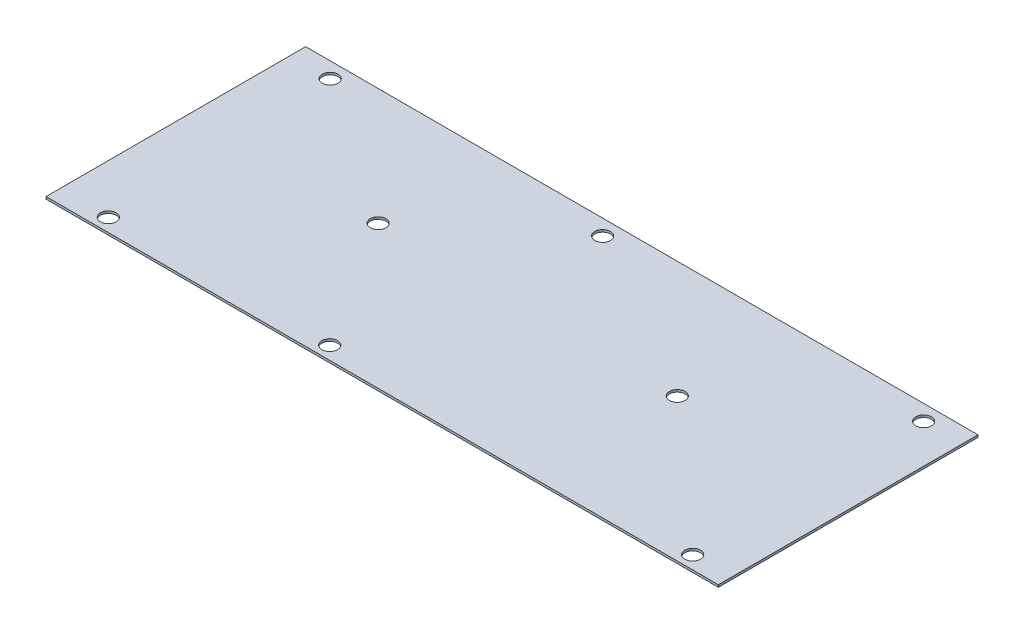
ISO-10303-21;
HEADER;
FILE_DESCRIPTION(('STEP AP214'),'2;1');
FILE_NAME('part.step','',(''),(''),'','','');
FILE_SCHEMA(('AUTOMOTIVE_DESIGN { 1 0 10303 214 1 1 1 1 }'));
ENDSEC;
DATA;
#1=APPLICATION_CONTEXT('core data for automotive mechanical design processes');
#2=APPLICATION_PROTOCOL_DEFINITION('international standard','automotive_design',2000,#1);
#3=PRODUCT_CONTEXT('',#1,'mechanical');
#4=PRODUCT('Part','Part','',(#3));
#5=PRODUCT_RELATED_PRODUCT_CATEGORY('part','',(#4));
#6=PRODUCT_DEFINITION_FORMATION('','',#4);
#7=PRODUCT_DEFINITION_CONTEXT('part definition',#1,'design');
#8=PRODUCT_DEFINITION('design','',#6,#7);
#9=PRODUCT_DEFINITION_SHAPE('','',#8);
#10=(LENGTH_UNIT() NAMED_UNIT(*) SI_UNIT(.MILLI.,.METRE.));
#11=(NAMED_UNIT(*) PLANE_ANGLE_UNIT() SI_UNIT($,.RADIAN.));
#12=(NAMED_UNIT(*) SI_UNIT($,.STERADIAN.) SOLID_ANGLE_UNIT());
#13=UNCERTAINTY_MEASURE_WITH_UNIT(LENGTH_MEASURE(1.E-05),#10,'distance_accuracy_value','');
#14=(GEOMETRIC_REPRESENTATION_CONTEXT(3) GLOBAL_UNCERTAINTY_ASSIGNED_CONTEXT((#13)) GLOBAL_UNIT_ASSIGNED_CONTEXT((#10,
#11,#12)) REPRESENTATION_CONTEXT('',''));
#15=CARTESIAN_POINT('',(0.,0.,0.));
#16=DIRECTION('',(0.,0.,1.));
#17=DIRECTION('',(1.,0.,0.));
#18=AXIS2_PLACEMENT_3D('',#15,#16,#17);
#19=CARTESIAN_POINT('',(0.,1.016,0.));
#20=DIRECTION('',(0.,-1.,0.));
#21=DIRECTION('',(0.,0.,-1.));
#22=AXIS2_PLACEMENT_3D('',#19,#20,#21);
#23=PLANE('',#22);
#24=DIRECTION('',(0.,0.,-1.));
#25=VECTOR('',#24,1.);
#26=CARTESIAN_POINT('',(150.0251,1.016,57.9374));
#27=LINE('',#26,#25);
#28=CARTESIAN_POINT('',(150.0251,1.016,57.9374));
#29=VERTEX_POINT('',#28);
#30=CARTESIAN_POINT('',(150.0251,1.016,-57.9374));
#31=VERTEX_POINT('',#30);
#32=EDGE_CURVE('E101',#29,#31,#27,.T.);
#33=ORIENTED_EDGE('',*,*,#32,.T.);
#34=DIRECTION('',(-1.,0.,0.));
#35=VECTOR('',#34,1.);
#36=CARTESIAN_POINT('',(-150.0251,1.016,-57.9374));
#37=LINE('',#36,#35);
#38=CARTESIAN_POINT('',(-150.0251,1.016,-57.9374));
#39=VERTEX_POINT('',#38);
#40=EDGE_CURVE('E96',#31,#39,#37,.T.);
#41=ORIENTED_EDGE('',*,*,#40,.T.);
#42=DIRECTION('',(0.,0.,1.));
#43=VECTOR('',#42,1.);
#44=CARTESIAN_POINT('',(-150.0251,1.016,57.9374));
#45=LINE('',#44,#43);
#46=CARTESIAN_POINT('',(-150.0251,1.016,57.9374));
#47=VERTEX_POINT('',#46);
#48=EDGE_CURVE('E99',#39,#47,#45,.T.);
#49=ORIENTED_EDGE('',*,*,#48,.T.);
#50=DIRECTION('',(1.,0.,0.));
#51=VECTOR('',#50,1.);
#52=CARTESIAN_POINT('',(-150.0251,1.016,57.9374));
#53=LINE('',#52,#51);
#54=EDGE_CURVE('E66',#47,#29,#53,.T.);
#55=ORIENTED_EDGE('',*,*,#54,.T.);
#56=EDGE_LOOP('',(#33,#41,#49,#55));
#57=FACE_BOUND('',#56,.T.);
#58=CARTESIAN_POINT('',(-128.1049,1.016,52.0446));
#59=DIRECTION('',(0.,1.,0.));
#60=DIRECTION('',(0.,0.,1.));
#61=AXIS2_PLACEMENT_3D('',#58,#59,#60);
#62=CIRCLE('',#61,3.50519999999998);
#63=CARTESIAN_POINT('',(-128.1049,1.016,55.5498));
#64=VERTEX_POINT('',#63);
#65=EDGE_CURVE('E129',#64,#64,#62,.T.);
#66=ORIENTED_EDGE('',*,*,#65,.F.);
#67=EDGE_LOOP('',(#66));
#68=FACE_BOUND('',#67,.T.);
#69=CARTESIAN_POINT('',(-132.1689,1.016,-51.0286));
#70=DIRECTION('',(0.,1.,0.));
#71=DIRECTION('',(0.,0.,1.));
#72=AXIS2_PLACEMENT_3D('',#69,#70,#71);
#73=CIRCLE('',#72,3.50520000000001);
#74=CARTESIAN_POINT('',(-132.1689,1.016,-47.5234));
#75=VERTEX_POINT('',#74);
#76=EDGE_CURVE('E140',#75,#75,#73,.T.);
#77=ORIENTED_EDGE('',*,*,#76,.F.);
#78=EDGE_LOOP('',(#77));
#79=FACE_BOUND('',#78,.T.);
#80=CARTESIAN_POINT('',(-10.5791,1.016,-51.0286));
#81=DIRECTION('',(0.,1.,0.));
#82=DIRECTION('',(0.,0.,1.));
#83=AXIS2_PLACEMENT_3D('',#80,#81,#82);
#84=CIRCLE('',#83,3.50519999999999);
#85=CARTESIAN_POINT('',(-10.5791,1.016,-47.5234));
#86=VERTEX_POINT('',#85);
#87=EDGE_CURVE('E166',#86,#86,#84,.T.);
#88=ORIENTED_EDGE('',*,*,#87,.F.);
#89=EDGE_LOOP('',(#88));
#90=FACE_BOUND('',#89,.T.);
#91=CARTESIAN_POINT('',(132.6769,1.016,-51.0286));
#92=DIRECTION('',(0.,1.,0.));
#93=DIRECTION('',(0.,0.,1.));
#94=AXIS2_PLACEMENT_3D('',#91,#92,#93);
#95=CIRCLE('',#94,3.50519999999998);
#96=CARTESIAN_POINT('',(132.6769,1.016,-47.5234));
#97=VERTEX_POINT('',#96);
#98=EDGE_CURVE('E173',#97,#97,#95,.T.);
#99=ORIENTED_EDGE('',*,*,#98,.F.);
#100=EDGE_LOOP('',(#99));
#101=FACE_BOUND('',#100,.T.);
#102=CARTESIAN_POINT('',(132.6769,1.016,52.0446));
#103=DIRECTION('',(0.,1.,0.));
#104=DIRECTION('',(0.,0.,1.));
#105=AXIS2_PLACEMENT_3D('',#102,#103,#104);
#106=CIRCLE('',#105,3.50519999999998);
#107=CARTESIAN_POINT('',(132.6769,1.016,55.5498));
#108=VERTEX_POINT('',#107);
#109=EDGE_CURVE('E181',#108,#108,#106,.T.);
#110=ORIENTED_EDGE('',*,*,#109,.F.);
#111=EDGE_LOOP('',(#110));
#112=FACE_BOUND('',#111,.T.);
#113=CARTESIAN_POINT('',(-29.2989,1.016,52.0446));
#114=DIRECTION('',(0.,1.,0.));
#115=DIRECTION('',(0.,0.,1.));
#116=AXIS2_PLACEMENT_3D('',#113,#114,#115);
#117=CIRCLE('',#116,3.5052);
#118=CARTESIAN_POINT('',(-29.2989,1.016,55.5498));
#119=VERTEX_POINT('',#118);
#120=EDGE_CURVE('E189',#119,#119,#117,.T.);
#121=ORIENTED_EDGE('',*,*,#120,.F.);
#122=EDGE_LOOP('',(#121));
#123=FACE_BOUND('',#122,.T.);
#124=CARTESIAN_POINT('',(67.9069,1.016,-5.86739999999999));
#125=DIRECTION('',(0.,1.,0.));
#126=DIRECTION('',(0.,0.,1.));
#127=AXIS2_PLACEMENT_3D('',#124,#125,#126);
#128=CIRCLE('',#127,3.50519999999999);
#129=CARTESIAN_POINT('',(67.9069,1.016,-2.3622));
#130=VERTEX_POINT('',#129);
#131=EDGE_CURVE('E197',#130,#130,#128,.T.);
#132=ORIENTED_EDGE('',*,*,#131,.F.);
#133=EDGE_LOOP('',(#132));
#134=FACE_BOUND('',#133,.T.);
#135=CARTESIAN_POINT('',(-65.6209,1.016,-5.8674));
#136=DIRECTION('',(0.,1.,0.));
#137=DIRECTION('',(0.,0.,1.));
#138=AXIS2_PLACEMENT_3D('',#135,#136,#137);
#139=CIRCLE('',#138,3.50519999999999);
#140=CARTESIAN_POINT('',(-65.6209,1.016,-2.36220000000001));
#141=VERTEX_POINT('',#140);
#142=EDGE_CURVE('E205',#141,#141,#139,.T.);
#143=ORIENTED_EDGE('',*,*,#142,.F.);
#144=EDGE_LOOP('',(#143));
#145=FACE_BOUND('',#144,.T.);
#146=ADVANCED_FACE('F48',(#57,#68,#79,#90,#101,#112,#123,#134,#145),#23,.F.);
#147=CARTESIAN_POINT('',(0.,0.,0.));
#148=DIRECTION('',(0.,-1.,0.));
#149=DIRECTION('',(0.,0.,-1.));
#150=AXIS2_PLACEMENT_3D('',#147,#148,#149);
#151=PLANE('',#150);
#152=CARTESIAN_POINT('',(67.9069,0.,-5.86739999999999));
#153=DIRECTION('',(0.,1.,0.));
#154=DIRECTION('',(0.,0.,1.));
#155=AXIS2_PLACEMENT_3D('',#152,#153,#154);
#156=CIRCLE('',#155,3.50519999999999);
#157=CARTESIAN_POINT('',(67.9069,0.,-2.3622));
#158=VERTEX_POINT('',#157);
#159=EDGE_CURVE('E201',#158,#158,#156,.T.);
#160=ORIENTED_EDGE('',*,*,#159,.T.);
#161=EDGE_LOOP('',(#160));
#162=FACE_BOUND('',#161,.T.);
#163=CARTESIAN_POINT('',(132.6769,0.,52.0446));
#164=DIRECTION('',(0.,1.,0.));
#165=DIRECTION('',(0.,0.,1.));
#166=AXIS2_PLACEMENT_3D('',#163,#164,#165);
#167=CIRCLE('',#166,3.50519999999998);
#168=CARTESIAN_POINT('',(132.6769,0.,55.5498));
#169=VERTEX_POINT('',#168);
#170=EDGE_CURVE('E185',#169,#169,#167,.T.);
#171=ORIENTED_EDGE('',*,*,#170,.T.);
#172=EDGE_LOOP('',(#171));
#173=FACE_BOUND('',#172,.T.);
#174=CARTESIAN_POINT('',(-10.5791,0.,-51.0286));
#175=DIRECTION('',(0.,1.,0.));
#176=DIRECTION('',(0.,0.,1.));
#177=AXIS2_PLACEMENT_3D('',#174,#175,#176);
#178=CIRCLE('',#177,3.50519999999999);
#179=CARTESIAN_POINT('',(-10.5791,0.,-47.5234));
#180=VERTEX_POINT('',#179);
#181=EDGE_CURVE('E169',#180,#180,#178,.T.);
#182=ORIENTED_EDGE('',*,*,#181,.T.);
#183=EDGE_LOOP('',(#182));
#184=FACE_BOUND('',#183,.T.);
#185=CARTESIAN_POINT('',(-128.1049,0.,52.0446));
#186=DIRECTION('',(0.,1.,0.));
#187=DIRECTION('',(0.,0.,1.));
#188=AXIS2_PLACEMENT_3D('',#185,#186,#187);
#189=CIRCLE('',#188,3.50519999999998);
#190=CARTESIAN_POINT('',(-128.1049,0.,55.5498));
#191=VERTEX_POINT('',#190);
#192=EDGE_CURVE('E136',#191,#191,#189,.T.);
#193=ORIENTED_EDGE('',*,*,#192,.T.);
#194=EDGE_LOOP('',(#193));
#195=FACE_BOUND('',#194,.T.);
#196=DIRECTION('',(0.,0.,-1.));
#197=VECTOR('',#196,1.);
#198=CARTESIAN_POINT('',(150.0251,0.,57.9374));
#199=LINE('',#198,#197);
#200=CARTESIAN_POINT('',(150.0251,0.,57.9374));
#201=VERTEX_POINT('',#200);
#202=CARTESIAN_POINT('',(150.0251,0.,-57.9374));
#203=VERTEX_POINT('',#202);
#204=EDGE_CURVE('E135',#201,#203,#199,.T.);
#205=ORIENTED_EDGE('',*,*,#204,.F.);
#206=DIRECTION('',(1.,0.,0.));
#207=VECTOR('',#206,1.);
#208=CARTESIAN_POINT('',(-150.0251,0.,57.9374));
#209=LINE('',#208,#207);
#210=CARTESIAN_POINT('',(-150.0251,0.,57.9374));
#211=VERTEX_POINT('',#210);
#212=EDGE_CURVE('E89',#211,#201,#209,.T.);
#213=ORIENTED_EDGE('',*,*,#212,.F.);
#214=DIRECTION('',(0.,0.,1.));
#215=VECTOR('',#214,1.);
#216=CARTESIAN_POINT('',(-150.0251,0.,57.9374));
#217=LINE('',#216,#215);
#218=CARTESIAN_POINT('',(-150.0251,0.,-57.9374));
#219=VERTEX_POINT('',#218);
#220=EDGE_CURVE('E83',#219,#211,#217,.T.);
#221=ORIENTED_EDGE('',*,*,#220,.F.);
#222=DIRECTION('',(-1.,0.,0.));
#223=VECTOR('',#222,1.);
#224=CARTESIAN_POINT('',(-150.0251,0.,-57.9374));
#225=LINE('',#224,#223);
#226=EDGE_CURVE('E106',#203,#219,#225,.T.);
#227=ORIENTED_EDGE('',*,*,#226,.F.);
#228=EDGE_LOOP('',(#205,#213,#221,#227));
#229=FACE_BOUND('',#228,.T.);
#230=CARTESIAN_POINT('',(-132.1689,0.,-51.0286));
#231=DIRECTION('',(0.,1.,0.));
#232=DIRECTION('',(0.,0.,1.));
#233=AXIS2_PLACEMENT_3D('',#230,#231,#232);
#234=CIRCLE('',#233,3.50520000000001);
#235=CARTESIAN_POINT('',(-132.1689,0.,-47.5234));
#236=VERTEX_POINT('',#235);
#237=EDGE_CURVE('E137',#236,#236,#234,.T.);
#238=ORIENTED_EDGE('',*,*,#237,.T.);
#239=EDGE_LOOP('',(#238));
#240=FACE_BOUND('',#239,.T.);
#241=CARTESIAN_POINT('',(132.6769,0.,-51.0286));
#242=DIRECTION('',(0.,1.,0.));
#243=DIRECTION('',(0.,0.,1.));
#244=AXIS2_PLACEMENT_3D('',#241,#242,#243);
#245=CIRCLE('',#244,3.50519999999998);
#246=CARTESIAN_POINT('',(132.6769,0.,-47.5234));
#247=VERTEX_POINT('',#246);
#248=EDGE_CURVE('E177',#247,#247,#245,.T.);
#249=ORIENTED_EDGE('',*,*,#248,.T.);
#250=EDGE_LOOP('',(#249));
#251=FACE_BOUND('',#250,.T.);
#252=CARTESIAN_POINT('',(-29.2989,0.,52.0446));
#253=DIRECTION('',(0.,1.,0.));
#254=DIRECTION('',(0.,0.,1.));
#255=AXIS2_PLACEMENT_3D('',#252,#253,#254);
#256=CIRCLE('',#255,3.5052);
#257=CARTESIAN_POINT('',(-29.2989,0.,55.5498));
#258=VERTEX_POINT('',#257);
#259=EDGE_CURVE('E193',#258,#258,#256,.T.);
#260=ORIENTED_EDGE('',*,*,#259,.T.);
#261=EDGE_LOOP('',(#260));
#262=FACE_BOUND('',#261,.T.);
#263=CARTESIAN_POINT('',(-65.6209,0.,-5.8674));
#264=DIRECTION('',(0.,1.,0.));
#265=DIRECTION('',(0.,0.,1.));
#266=AXIS2_PLACEMENT_3D('',#263,#264,#265);
#267=CIRCLE('',#266,3.50519999999999);
#268=CARTESIAN_POINT('',(-65.6209,0.,-2.36220000000001));
#269=VERTEX_POINT('',#268);
#270=EDGE_CURVE('E209',#269,#269,#267,.T.);
#271=ORIENTED_EDGE('',*,*,#270,.T.);
#272=EDGE_LOOP('',(#271));
#273=FACE_BOUND('',#272,.T.);
#274=ADVANCED_FACE('F155',(#162,#173,#184,#195,#229,#240,#251,#262,#273),#151,.T.);
#275=CARTESIAN_POINT('',(150.0251,1.016,57.9374));
#276=DIRECTION('',(-1.,0.,0.));
#277=DIRECTION('',(0.,0.,1.));
#278=AXIS2_PLACEMENT_3D('',#275,#276,#277);
#279=PLANE('',#278);
#280=ORIENTED_EDGE('',*,*,#204,.T.);
#281=DIRECTION('',(0.,-1.,0.));
#282=VECTOR('',#281,1.);
#283=CARTESIAN_POINT('',(150.0251,1.016,-57.9374));
#284=LINE('',#283,#282);
#285=EDGE_CURVE('E12',#31,#203,#284,.T.);
#286=ORIENTED_EDGE('',*,*,#285,.F.);
#287=ORIENTED_EDGE('',*,*,#32,.F.);
#288=DIRECTION('',(0.,-1.,0.));
#289=VECTOR('',#288,1.);
#290=CARTESIAN_POINT('',(150.0251,1.016,57.9374));
#291=LINE('',#290,#289);
#292=EDGE_CURVE('E113',#29,#201,#291,.T.);
#293=ORIENTED_EDGE('',*,*,#292,.T.);
#294=EDGE_LOOP('',(#280,#286,#287,#293));
#295=FACE_BOUND('',#294,.T.);
#296=ADVANCED_FACE('F50',(#295),#279,.F.);
#297=CARTESIAN_POINT('',(-150.0251,1.016,-57.9374));
#298=DIRECTION('',(0.,0.,1.));
#299=DIRECTION('',(1.,0.,0.));
#300=AXIS2_PLACEMENT_3D('',#297,#298,#299);
#301=PLANE('',#300);
#302=ORIENTED_EDGE('',*,*,#226,.T.);
#303=DIRECTION('',(0.,-1.,0.));
#304=VECTOR('',#303,1.);
#305=CARTESIAN_POINT('',(-150.0251,1.016,-57.9374));
#306=LINE('',#305,#304);
#307=EDGE_CURVE('E58',#39,#219,#306,.T.);
#308=ORIENTED_EDGE('',*,*,#307,.F.);
#309=ORIENTED_EDGE('',*,*,#40,.F.);
#310=ORIENTED_EDGE('',*,*,#285,.T.);
#311=EDGE_LOOP('',(#302,#308,#309,#310));
#312=FACE_BOUND('',#311,.T.);
#313=ADVANCED_FACE('F105',(#312),#301,.F.);
#314=CARTESIAN_POINT('',(-150.0251,1.016,57.9374));
#315=DIRECTION('',(1.,0.,0.));
#316=DIRECTION('',(0.,0.,-1.));
#317=AXIS2_PLACEMENT_3D('',#314,#315,#316);
#318=PLANE('',#317);
#319=ORIENTED_EDGE('',*,*,#220,.T.);
#320=DIRECTION('',(0.,-1.,0.));
#321=VECTOR('',#320,1.);
#322=CARTESIAN_POINT('',(-150.0251,1.016,57.9374));
#323=LINE('',#322,#321);
#324=EDGE_CURVE('E108',#47,#211,#323,.T.);
#325=ORIENTED_EDGE('',*,*,#324,.F.);
#326=ORIENTED_EDGE('',*,*,#48,.F.);
#327=ORIENTED_EDGE('',*,*,#307,.T.);
#328=EDGE_LOOP('',(#319,#325,#326,#327));
#329=FACE_BOUND('',#328,.T.);
#330=ADVANCED_FACE('F109',(#329),#318,.F.);
#331=CARTESIAN_POINT('',(-150.0251,1.016,57.9374));
#332=DIRECTION('',(0.,0.,-1.));
#333=DIRECTION('',(-1.,0.,0.));
#334=AXIS2_PLACEMENT_3D('',#331,#332,#333);
#335=PLANE('',#334);
#336=ORIENTED_EDGE('',*,*,#212,.T.);
#337=ORIENTED_EDGE('',*,*,#292,.F.);
#338=ORIENTED_EDGE('',*,*,#54,.F.);
#339=ORIENTED_EDGE('',*,*,#324,.T.);
#340=EDGE_LOOP('',(#336,#337,#338,#339));
#341=FACE_BOUND('',#340,.T.);
#342=ADVANCED_FACE('F152',(#341),#335,.F.);
#343=CARTESIAN_POINT('',(-128.1049,1.016,52.0446));
#344=DIRECTION('',(0.,-1.,0.));
#345=DIRECTION('',(0.,0.,-1.));
#346=AXIS2_PLACEMENT_3D('',#343,#344,#345);
#347=CYLINDRICAL_SURFACE('',#346,3.50519999999998);
#348=ORIENTED_EDGE('',*,*,#65,.T.);
#349=EDGE_LOOP('',(#348));
#350=FACE_BOUND('',#349,.T.);
#351=ORIENTED_EDGE('',*,*,#192,.F.);
#352=EDGE_LOOP('',(#351));
#353=FACE_BOUND('',#352,.T.);
#354=ADVANCED_FACE('F244',(#350,#353),#347,.F.);
#355=CARTESIAN_POINT('',(-132.1689,1.016,-51.0286));
#356=DIRECTION('',(0.,-1.,0.));
#357=DIRECTION('',(0.,0.,-1.));
#358=AXIS2_PLACEMENT_3D('',#355,#356,#357);
#359=CYLINDRICAL_SURFACE('',#358,3.50520000000001);
#360=ORIENTED_EDGE('',*,*,#76,.T.);
#361=EDGE_LOOP('',(#360));
#362=FACE_BOUND('',#361,.T.);
#363=ORIENTED_EDGE('',*,*,#237,.F.);
#364=EDGE_LOOP('',(#363));
#365=FACE_BOUND('',#364,.T.);
#366=ADVANCED_FACE('F270',(#362,#365),#359,.F.);
#367=CARTESIAN_POINT('',(-10.5791,1.016,-51.0286));
#368=DIRECTION('',(0.,-1.,0.));
#369=DIRECTION('',(0.,0.,-1.));
#370=AXIS2_PLACEMENT_3D('',#367,#368,#369);
#371=CYLINDRICAL_SURFACE('',#370,3.50519999999999);
#372=ORIENTED_EDGE('',*,*,#87,.T.);
#373=EDGE_LOOP('',(#372));
#374=FACE_BOUND('',#373,.T.);
#375=ORIENTED_EDGE('',*,*,#181,.F.);
#376=EDGE_LOOP('',(#375));
#377=FACE_BOUND('',#376,.T.);
#378=ADVANCED_FACE('F279',(#374,#377),#371,.F.);
#379=CARTESIAN_POINT('',(132.6769,1.016,-51.0286));
#380=DIRECTION('',(0.,-1.,0.));
#381=DIRECTION('',(0.,0.,-1.));
#382=AXIS2_PLACEMENT_3D('',#379,#380,#381);
#383=CYLINDRICAL_SURFACE('',#382,3.50519999999998);
#384=ORIENTED_EDGE('',*,*,#98,.T.);
#385=EDGE_LOOP('',(#384));
#386=FACE_BOUND('',#385,.T.);
#387=ORIENTED_EDGE('',*,*,#248,.F.);
#388=EDGE_LOOP('',(#387));
#389=FACE_BOUND('',#388,.T.);
#390=ADVANCED_FACE('F287',(#386,#389),#383,.F.);
#391=CARTESIAN_POINT('',(132.6769,1.016,52.0446));
#392=DIRECTION('',(0.,-1.,0.));
#393=DIRECTION('',(0.,0.,-1.));
#394=AXIS2_PLACEMENT_3D('',#391,#392,#393);
#395=CYLINDRICAL_SURFACE('',#394,3.50519999999998);
#396=ORIENTED_EDGE('',*,*,#109,.T.);
#397=EDGE_LOOP('',(#396));
#398=FACE_BOUND('',#397,.T.);
#399=ORIENTED_EDGE('',*,*,#170,.F.);
#400=EDGE_LOOP('',(#399));
#401=FACE_BOUND('',#400,.T.);
#402=ADVANCED_FACE('F296',(#398,#401),#395,.F.);
#403=CARTESIAN_POINT('',(-29.2989,1.016,52.0446));
#404=DIRECTION('',(0.,-1.,0.));
#405=DIRECTION('',(0.,0.,-1.));
#406=AXIS2_PLACEMENT_3D('',#403,#404,#405);
#407=CYLINDRICAL_SURFACE('',#406,3.5052);
#408=ORIENTED_EDGE('',*,*,#120,.T.);
#409=EDGE_LOOP('',(#408));
#410=FACE_BOUND('',#409,.T.);
#411=ORIENTED_EDGE('',*,*,#259,.F.);
#412=EDGE_LOOP('',(#411));
#413=FACE_BOUND('',#412,.T.);
#414=ADVANCED_FACE('F233',(#410,#413),#407,.F.);
#415=CARTESIAN_POINT('',(67.9069,1.016,-5.86739999999999));
#416=DIRECTION('',(0.,-1.,0.));
#417=DIRECTION('',(0.,0.,-1.));
#418=AXIS2_PLACEMENT_3D('',#415,#416,#417);
#419=CYLINDRICAL_SURFACE('',#418,3.50519999999999);
#420=ORIENTED_EDGE('',*,*,#131,.T.);
#421=EDGE_LOOP('',(#420));
#422=FACE_BOUND('',#421,.T.);
#423=ORIENTED_EDGE('',*,*,#159,.F.);
#424=EDGE_LOOP('',(#423));
#425=FACE_BOUND('',#424,.T.);
#426=ADVANCED_FACE('F227',(#422,#425),#419,.F.);
#427=CARTESIAN_POINT('',(-65.6209,1.016,-5.8674));
#428=DIRECTION('',(0.,-1.,0.));
#429=DIRECTION('',(0.,0.,-1.));
#430=AXIS2_PLACEMENT_3D('',#427,#428,#429);
#431=CYLINDRICAL_SURFACE('',#430,3.50519999999999);
#432=ORIENTED_EDGE('',*,*,#142,.T.);
#433=EDGE_LOOP('',(#432));
#434=FACE_BOUND('',#433,.T.);
#435=ORIENTED_EDGE('',*,*,#270,.F.);
#436=EDGE_LOOP('',(#435));
#437=FACE_BOUND('',#436,.T.);
#438=ADVANCED_FACE('F225',(#434,#437),#431,.F.);
#439=CLOSED_SHELL('',(#146,#274,#296,#313,#330,#342,#354,#366,#378,#390,#402,#414,#426,#438));
#440=MANIFOLD_SOLID_BREP('B2',#439);
#441=ADVANCED_BREP_SHAPE_REPRESENTATION('',(#18,#440),#14);
#442=SHAPE_DEFINITION_REPRESENTATION(#9,#441);
ENDSEC;
END-ISO-10303-21;
